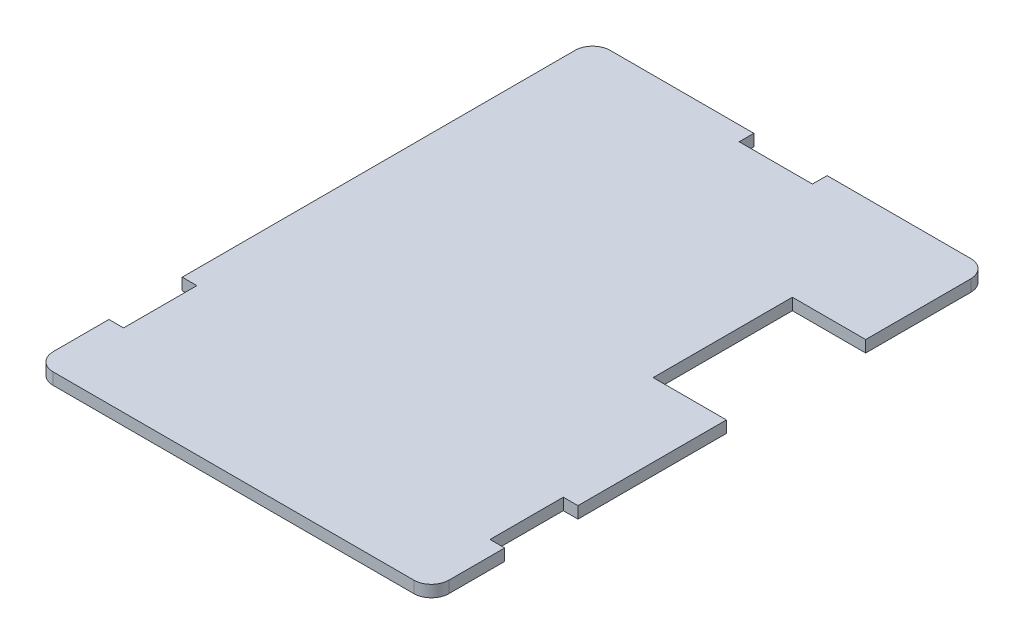
ISO-10303-21;
HEADER;
FILE_DESCRIPTION(('STEP AP214'),'2;1');
FILE_NAME('part.step','',(''),(''),'','','');
FILE_SCHEMA(('AUTOMOTIVE_DESIGN { 1 0 10303 214 1 1 1 1 }'));
ENDSEC;
DATA;
#1=APPLICATION_CONTEXT('core data for automotive mechanical design processes');
#2=APPLICATION_PROTOCOL_DEFINITION('international standard','automotive_design',2000,#1);
#3=PRODUCT_CONTEXT('',#1,'mechanical');
#4=PRODUCT('Part','Part','',(#3));
#5=PRODUCT_RELATED_PRODUCT_CATEGORY('part','',(#4));
#6=PRODUCT_DEFINITION_FORMATION('','',#4);
#7=PRODUCT_DEFINITION_CONTEXT('part definition',#1,'design');
#8=PRODUCT_DEFINITION('design','',#6,#7);
#9=PRODUCT_DEFINITION_SHAPE('','',#8);
#10=(LENGTH_UNIT() NAMED_UNIT(*) SI_UNIT(.MILLI.,.METRE.));
#11=(NAMED_UNIT(*) PLANE_ANGLE_UNIT() SI_UNIT($,.RADIAN.));
#12=(NAMED_UNIT(*) SI_UNIT($,.STERADIAN.) SOLID_ANGLE_UNIT());
#13=UNCERTAINTY_MEASURE_WITH_UNIT(LENGTH_MEASURE(1.E-05),#10,'distance_accuracy_value','');
#14=(GEOMETRIC_REPRESENTATION_CONTEXT(3) GLOBAL_UNCERTAINTY_ASSIGNED_CONTEXT((#13)) GLOBAL_UNIT_ASSIGNED_CONTEXT((#10,
#11,#12)) REPRESENTATION_CONTEXT('',''));
#15=CARTESIAN_POINT('',(0.,0.,0.));
#16=DIRECTION('',(0.,0.,1.));
#17=DIRECTION('',(1.,0.,0.));
#18=AXIS2_PLACEMENT_3D('',#15,#16,#17);
#19=CARTESIAN_POINT('',(13.5,0.8,19.));
#20=DIRECTION('',(-1.,0.,0.));
#21=DIRECTION('',(0.,0.,1.));
#22=AXIS2_PLACEMENT_3D('',#19,#20,#21);
#23=PLANE('',#22);
#24=DIRECTION('',(0.,0.,-1.));
#25=VECTOR('',#24,1.);
#26=CARTESIAN_POINT('',(13.5,0.,19.));
#27=LINE('',#26,#25);
#28=CARTESIAN_POINT('',(13.5,0.,17.8));
#29=VERTEX_POINT('',#28);
#30=CARTESIAN_POINT('',(13.5,0.,14.));
#31=VERTEX_POINT('',#30);
#32=EDGE_CURVE('E308',#29,#31,#27,.T.);
#33=ORIENTED_EDGE('',*,*,#32,.T.);
#34=DIRECTION('',(0.,1.,0.));
#35=VECTOR('',#34,1.);
#36=CARTESIAN_POINT('',(13.5,-9.2,14.));
#37=LINE('',#36,#35);
#38=CARTESIAN_POINT('',(13.5,0.8,14.));
#39=VERTEX_POINT('',#38);
#40=EDGE_CURVE('E256',#31,#39,#37,.T.);
#41=ORIENTED_EDGE('',*,*,#40,.T.);
#42=DIRECTION('',(0.,0.,-1.));
#43=VECTOR('',#42,1.);
#44=CARTESIAN_POINT('',(13.5,0.8,19.));
#45=LINE('',#44,#43);
#46=CARTESIAN_POINT('',(13.5,0.8,17.8));
#47=VERTEX_POINT('',#46);
#48=EDGE_CURVE('E292',#47,#39,#45,.T.);
#49=ORIENTED_EDGE('',*,*,#48,.F.);
#50=DIRECTION('',(0.,-1.,0.));
#51=VECTOR('',#50,1.);
#52=CARTESIAN_POINT('',(13.5,0.8,17.8));
#53=LINE('',#52,#51);
#54=EDGE_CURVE('E325',#47,#29,#53,.T.);
#55=ORIENTED_EDGE('',*,*,#54,.T.);
#56=EDGE_LOOP('',(#33,#41,#49,#55));
#57=FACE_BOUND('',#56,.T.);
#58=ADVANCED_FACE('F44',(#57),#23,.F.);
#59=CARTESIAN_POINT('',(-13.5,0.8,-19.));
#60=DIRECTION('',(0.,0.,1.));
#61=DIRECTION('',(1.,0.,0.));
#62=AXIS2_PLACEMENT_3D('',#59,#60,#61);
#63=PLANE('',#62);
#64=DIRECTION('',(-1.,0.,0.));
#65=VECTOR('',#64,1.);
#66=CARTESIAN_POINT('',(-13.5,0.8,-19.));
#67=LINE('',#66,#65);
#68=CARTESIAN_POINT('',(-2.5,0.8,-19.));
#69=VERTEX_POINT('',#68);
#70=CARTESIAN_POINT('',(-12.3,0.8,-19.));
#71=VERTEX_POINT('',#70);
#72=EDGE_CURVE('E295',#69,#71,#67,.T.);
#73=ORIENTED_EDGE('',*,*,#72,.F.);
#74=DIRECTION('',(0.,1.,0.));
#75=VECTOR('',#74,1.);
#76=CARTESIAN_POINT('',(-2.5,-9.2,-19.));
#77=LINE('',#76,#75);
#78=CARTESIAN_POINT('',(-2.5,0.,-19.));
#79=VERTEX_POINT('',#78);
#80=EDGE_CURVE('E218',#79,#69,#77,.T.);
#81=ORIENTED_EDGE('',*,*,#80,.F.);
#82=DIRECTION('',(-1.,0.,0.));
#83=VECTOR('',#82,1.);
#84=CARTESIAN_POINT('',(-13.5,0.,-19.));
#85=LINE('',#84,#83);
#86=CARTESIAN_POINT('',(-12.3,0.,-19.));
#87=VERTEX_POINT('',#86);
#88=EDGE_CURVE('E311',#79,#87,#85,.T.);
#89=ORIENTED_EDGE('',*,*,#88,.T.);
#90=DIRECTION('',(0.,-1.,0.));
#91=VECTOR('',#90,1.);
#92=CARTESIAN_POINT('',(-12.3,0.8,-19.));
#93=LINE('',#92,#91);
#94=EDGE_CURVE('E358',#87,#71,#93,.F.);
#95=ORIENTED_EDGE('',*,*,#94,.T.);
#96=EDGE_LOOP('',(#73,#81,#89,#95));
#97=FACE_BOUND('',#96,.T.);
#98=ADVANCED_FACE('F385',(#97),#63,.F.);
#99=CARTESIAN_POINT('',(-13.5,0.8,19.));
#100=DIRECTION('',(1.,0.,0.));
#101=DIRECTION('',(0.,0.,-1.));
#102=AXIS2_PLACEMENT_3D('',#99,#100,#101);
#103=PLANE('',#102);
#104=DIRECTION('',(0.,0.,1.));
#105=VECTOR('',#104,1.);
#106=CARTESIAN_POINT('',(-13.5,0.,19.));
#107=LINE('',#106,#105);
#108=CARTESIAN_POINT('',(-13.5,0.,-17.8));
#109=VERTEX_POINT('',#108);
#110=CARTESIAN_POINT('',(-13.5,0.,8.99999999999999));
#111=VERTEX_POINT('',#110);
#112=EDGE_CURVE('E317',#109,#111,#107,.T.);
#113=ORIENTED_EDGE('',*,*,#112,.T.);
#114=DIRECTION('',(0.,1.,0.));
#115=VECTOR('',#114,1.);
#116=CARTESIAN_POINT('',(-13.5,-9.2,8.99999999999999));
#117=LINE('',#116,#115);
#118=CARTESIAN_POINT('',(-13.5,0.8,8.99999999999999));
#119=VERTEX_POINT('',#118);
#120=EDGE_CURVE('E240',#111,#119,#117,.T.);
#121=ORIENTED_EDGE('',*,*,#120,.T.);
#122=DIRECTION('',(0.,0.,1.));
#123=VECTOR('',#122,1.);
#124=CARTESIAN_POINT('',(-13.5,0.8,19.));
#125=LINE('',#124,#123);
#126=CARTESIAN_POINT('',(-13.5,0.8,-17.8));
#127=VERTEX_POINT('',#126);
#128=EDGE_CURVE('E301',#127,#119,#125,.T.);
#129=ORIENTED_EDGE('',*,*,#128,.F.);
#130=DIRECTION('',(0.,-1.,0.));
#131=VECTOR('',#130,1.);
#132=CARTESIAN_POINT('',(-13.5,0.8,-17.8));
#133=LINE('',#132,#131);
#134=EDGE_CURVE('E352',#127,#109,#133,.T.);
#135=ORIENTED_EDGE('',*,*,#134,.T.);
#136=EDGE_LOOP('',(#113,#121,#129,#135));
#137=FACE_BOUND('',#136,.T.);
#138=ADVANCED_FACE('F393',(#137),#103,.F.);
#139=CARTESIAN_POINT('',(13.5,0.8,9.));
#140=VERTEX_POINT('',#139);
#141=CARTESIAN_POINT('',(13.5,0.8,-1.13));
#142=VERTEX_POINT('',#141);
#143=EDGE_CURVE('E296',#140,#142,#45,.T.);
#144=ORIENTED_EDGE('',*,*,#143,.F.);
#145=DIRECTION('',(0.,1.,0.));
#146=VECTOR('',#145,1.);
#147=CARTESIAN_POINT('',(13.5,-9.2,9.));
#148=LINE('',#147,#146);
#149=CARTESIAN_POINT('',(13.5,0.,9.));
#150=VERTEX_POINT('',#149);
#151=EDGE_CURVE('E249',#150,#140,#148,.T.);
#152=ORIENTED_EDGE('',*,*,#151,.F.);
#153=CARTESIAN_POINT('',(13.5,0.,-1.13));
#154=VERTEX_POINT('',#153);
#155=EDGE_CURVE('E312',#150,#154,#27,.T.);
#156=ORIENTED_EDGE('',*,*,#155,.T.);
#157=DIRECTION('',(0.,1.,0.));
#158=VECTOR('',#157,1.);
#159=CARTESIAN_POINT('',(13.5,-0.00100000000000002,-1.13));
#160=LINE('',#159,#158);
#161=EDGE_CURVE('E280',#154,#142,#160,.T.);
#162=ORIENTED_EDGE('',*,*,#161,.T.);
#163=EDGE_LOOP('',(#144,#152,#156,#162));
#164=FACE_BOUND('',#163,.T.);
#165=ADVANCED_FACE('F444',(#164),#23,.F.);
#166=CARTESIAN_POINT('',(13.5,0.8,-10.63));
#167=VERTEX_POINT('',#166);
#168=CARTESIAN_POINT('',(13.5,0.8,-17.8));
#169=VERTEX_POINT('',#168);
#170=EDGE_CURVE('E297',#167,#169,#45,.T.);
#171=ORIENTED_EDGE('',*,*,#170,.F.);
#172=DIRECTION('',(0.,1.,0.));
#173=VECTOR('',#172,1.);
#174=CARTESIAN_POINT('',(13.5,-0.00100000000000002,-10.63));
#175=LINE('',#174,#173);
#176=CARTESIAN_POINT('',(13.5,0.,-10.63));
#177=VERTEX_POINT('',#176);
#178=EDGE_CURVE('E279',#177,#167,#175,.T.);
#179=ORIENTED_EDGE('',*,*,#178,.F.);
#180=CARTESIAN_POINT('',(13.5,0.,-17.8));
#181=VERTEX_POINT('',#180);
#182=EDGE_CURVE('E291',#177,#181,#27,.T.);
#183=ORIENTED_EDGE('',*,*,#182,.T.);
#184=DIRECTION('',(0.,-1.,0.));
#185=VECTOR('',#184,1.);
#186=CARTESIAN_POINT('',(13.5,0.8,-17.8));
#187=LINE('',#186,#185);
#188=EDGE_CURVE('E307',#181,#169,#187,.F.);
#189=ORIENTED_EDGE('',*,*,#188,.T.);
#190=EDGE_LOOP('',(#171,#179,#183,#189));
#191=FACE_BOUND('',#190,.T.);
#192=ADVANCED_FACE('F454',(#191),#23,.F.);
#193=CARTESIAN_POINT('',(12.3,0.,-19.));
#194=VERTEX_POINT('',#193);
#195=CARTESIAN_POINT('',(2.5,0.,-19.));
#196=VERTEX_POINT('',#195);
#197=EDGE_CURVE('E313',#194,#196,#85,.T.);
#198=ORIENTED_EDGE('',*,*,#197,.T.);
#199=DIRECTION('',(0.,1.,0.));
#200=VECTOR('',#199,1.);
#201=CARTESIAN_POINT('',(2.5,-9.2,-19.));
#202=LINE('',#201,#200);
#203=CARTESIAN_POINT('',(2.5,0.8,-19.));
#204=VERTEX_POINT('',#203);
#205=EDGE_CURVE('E230',#196,#204,#202,.T.);
#206=ORIENTED_EDGE('',*,*,#205,.T.);
#207=CARTESIAN_POINT('',(12.3,0.8,-19.));
#208=VERTEX_POINT('',#207);
#209=EDGE_CURVE('E298',#208,#204,#67,.T.);
#210=ORIENTED_EDGE('',*,*,#209,.F.);
#211=DIRECTION('',(0.,-1.,0.));
#212=VECTOR('',#211,1.);
#213=CARTESIAN_POINT('',(12.3,0.8,-19.));
#214=LINE('',#213,#212);
#215=EDGE_CURVE('E361',#208,#194,#214,.T.);
#216=ORIENTED_EDGE('',*,*,#215,.T.);
#217=EDGE_LOOP('',(#198,#206,#210,#216));
#218=FACE_BOUND('',#217,.T.);
#219=ADVANCED_FACE('F460',(#218),#63,.F.);
#220=CARTESIAN_POINT('',(-13.5,0.8,14.));
#221=VERTEX_POINT('',#220);
#222=CARTESIAN_POINT('',(-13.5,0.8,17.8));
#223=VERTEX_POINT('',#222);
#224=EDGE_CURVE('E300',#221,#223,#125,.T.);
#225=ORIENTED_EDGE('',*,*,#224,.F.);
#226=DIRECTION('',(0.,1.,0.));
#227=VECTOR('',#226,1.);
#228=CARTESIAN_POINT('',(-13.5,-9.2,14.));
#229=LINE('',#228,#227);
#230=CARTESIAN_POINT('',(-13.5,0.,14.));
#231=VERTEX_POINT('',#230);
#232=EDGE_CURVE('E234',#231,#221,#229,.T.);
#233=ORIENTED_EDGE('',*,*,#232,.F.);
#234=CARTESIAN_POINT('',(-13.5,0.,17.8));
#235=VERTEX_POINT('',#234);
#236=EDGE_CURVE('E316',#231,#235,#107,.T.);
#237=ORIENTED_EDGE('',*,*,#236,.T.);
#238=DIRECTION('',(0.,-1.,0.));
#239=VECTOR('',#238,1.);
#240=CARTESIAN_POINT('',(-13.5,0.8,17.8));
#241=LINE('',#240,#239);
#242=EDGE_CURVE('E355',#235,#223,#241,.F.);
#243=ORIENTED_EDGE('',*,*,#242,.T.);
#244=EDGE_LOOP('',(#225,#233,#237,#243));
#245=FACE_BOUND('',#244,.T.);
#246=ADVANCED_FACE('F408',(#245),#103,.F.);
#247=CARTESIAN_POINT('',(-13.5,0.8,19.));
#248=DIRECTION('',(0.,0.,-1.));
#249=DIRECTION('',(-1.,0.,0.));
#250=AXIS2_PLACEMENT_3D('',#247,#248,#249);
#251=PLANE('',#250);
#252=DIRECTION('',(1.,0.,0.));
#253=VECTOR('',#252,1.);
#254=CARTESIAN_POINT('',(-13.5,0.,19.));
#255=LINE('',#254,#253);
#256=CARTESIAN_POINT('',(-12.3,0.,19.));
#257=VERTEX_POINT('',#256);
#258=CARTESIAN_POINT('',(12.3,0.,19.));
#259=VERTEX_POINT('',#258);
#260=EDGE_CURVE('E320',#257,#259,#255,.T.);
#261=ORIENTED_EDGE('',*,*,#260,.T.);
#262=DIRECTION('',(0.,-1.,0.));
#263=VECTOR('',#262,1.);
#264=CARTESIAN_POINT('',(12.3,0.8,19.));
#265=LINE('',#264,#263);
#266=CARTESIAN_POINT('',(12.3,0.8,19.));
#267=VERTEX_POINT('',#266);
#268=EDGE_CURVE('E342',#259,#267,#265,.F.);
#269=ORIENTED_EDGE('',*,*,#268,.T.);
#270=DIRECTION('',(1.,0.,0.));
#271=VECTOR('',#270,1.);
#272=CARTESIAN_POINT('',(-13.5,0.8,19.));
#273=LINE('',#272,#271);
#274=CARTESIAN_POINT('',(-12.3,0.8,19.));
#275=VERTEX_POINT('',#274);
#276=EDGE_CURVE('E304',#275,#267,#273,.T.);
#277=ORIENTED_EDGE('',*,*,#276,.F.);
#278=DIRECTION('',(0.,-1.,0.));
#279=VECTOR('',#278,1.);
#280=CARTESIAN_POINT('',(-12.3,0.8,19.));
#281=LINE('',#280,#279);
#282=EDGE_CURVE('E339',#275,#257,#281,.T.);
#283=ORIENTED_EDGE('',*,*,#282,.T.);
#284=EDGE_LOOP('',(#261,#269,#277,#283));
#285=FACE_BOUND('',#284,.T.);
#286=ADVANCED_FACE('F418',(#285),#251,.F.);
#287=CARTESIAN_POINT('',(0.,0.8,0.));
#288=DIRECTION('',(0.,-1.,0.));
#289=DIRECTION('',(0.,0.,-1.));
#290=AXIS2_PLACEMENT_3D('',#287,#288,#289);
#291=PLANE('',#290);
#292=DIRECTION('',(1.,0.,0.));
#293=VECTOR('',#292,1.);
#294=CARTESIAN_POINT('',(-2.5,0.8,-18.));
#295=LINE('',#294,#293);
#296=CARTESIAN_POINT('',(-2.5,0.8,-18.));
#297=VERTEX_POINT('',#296);
#298=CARTESIAN_POINT('',(2.5,0.8,-18.));
#299=VERTEX_POINT('',#298);
#300=EDGE_CURVE('E206',#297,#299,#295,.T.);
#301=ORIENTED_EDGE('',*,*,#300,.F.);
#302=DIRECTION('',(0.,0.,1.));
#303=VECTOR('',#302,1.);
#304=CARTESIAN_POINT('',(-2.5,0.8,-19.));
#305=LINE('',#304,#303);
#306=EDGE_CURVE('E215',#69,#297,#305,.T.);
#307=ORIENTED_EDGE('',*,*,#306,.F.);
#308=ORIENTED_EDGE('',*,*,#72,.T.);
#309=CARTESIAN_POINT('',(-12.3,0.8,-17.8));
#310=DIRECTION('',(0.,-1.,0.));
#311=DIRECTION('',(0.,0.,-1.));
#312=AXIS2_PLACEMENT_3D('',#309,#310,#311);
#313=CIRCLE('',#312,1.2);
#314=EDGE_CURVE('E344',#71,#127,#313,.F.);
#315=ORIENTED_EDGE('',*,*,#314,.T.);
#316=ORIENTED_EDGE('',*,*,#128,.T.);
#317=DIRECTION('',(-1.,0.,0.));
#318=VECTOR('',#317,1.);
#319=CARTESIAN_POINT('',(-13.5,0.8,8.99999999999999));
#320=LINE('',#319,#318);
#321=CARTESIAN_POINT('',(-12.5,0.8,8.99999999999999));
#322=VERTEX_POINT('',#321);
#323=EDGE_CURVE('E236',#322,#119,#320,.T.);
#324=ORIENTED_EDGE('',*,*,#323,.F.);
#325=DIRECTION('',(0.,0.,-1.));
#326=VECTOR('',#325,1.);
#327=CARTESIAN_POINT('',(-12.5,0.8,8.99999999999999));
#328=LINE('',#327,#326);
#329=CARTESIAN_POINT('',(-12.5,0.8,14.));
#330=VERTEX_POINT('',#329);
#331=EDGE_CURVE('E245',#330,#322,#328,.T.);
#332=ORIENTED_EDGE('',*,*,#331,.F.);
#333=DIRECTION('',(1.,0.,0.));
#334=VECTOR('',#333,1.);
#335=CARTESIAN_POINT('',(-13.5,0.8,14.));
#336=LINE('',#335,#334);
#337=EDGE_CURVE('E221',#221,#330,#336,.T.);
#338=ORIENTED_EDGE('',*,*,#337,.F.);
#339=ORIENTED_EDGE('',*,*,#224,.T.);
#340=CARTESIAN_POINT('',(-12.3,0.8,17.8));
#341=DIRECTION('',(0.,-1.,0.));
#342=DIRECTION('',(0.,0.,-1.));
#343=AXIS2_PLACEMENT_3D('',#340,#341,#342);
#344=CIRCLE('',#343,1.2);
#345=EDGE_CURVE('E348',#223,#275,#344,.F.);
#346=ORIENTED_EDGE('',*,*,#345,.T.);
#347=ORIENTED_EDGE('',*,*,#276,.T.);
#348=CARTESIAN_POINT('',(12.3,0.8,17.8));
#349=DIRECTION('',(0.,-1.,0.));
#350=DIRECTION('',(0.,0.,-1.));
#351=AXIS2_PLACEMENT_3D('',#348,#349,#350);
#352=CIRCLE('',#351,1.2);
#353=EDGE_CURVE('E350',#267,#47,#352,.F.);
#354=ORIENTED_EDGE('',*,*,#353,.T.);
#355=ORIENTED_EDGE('',*,*,#48,.T.);
#356=DIRECTION('',(1.,0.,0.));
#357=VECTOR('',#356,1.);
#358=CARTESIAN_POINT('',(13.5,0.8,14.));
#359=LINE('',#358,#357);
#360=CARTESIAN_POINT('',(12.5,0.8,14.));
#361=VERTEX_POINT('',#360);
#362=EDGE_CURVE('E251',#361,#39,#359,.T.);
#363=ORIENTED_EDGE('',*,*,#362,.F.);
#364=DIRECTION('',(0.,0.,1.));
#365=VECTOR('',#364,1.);
#366=CARTESIAN_POINT('',(12.5,0.8,9.));
#367=LINE('',#366,#365);
#368=CARTESIAN_POINT('',(12.5,0.8,9.));
#369=VERTEX_POINT('',#368);
#370=EDGE_CURVE('E260',#369,#361,#367,.T.);
#371=ORIENTED_EDGE('',*,*,#370,.F.);
#372=DIRECTION('',(-1.,0.,0.));
#373=VECTOR('',#372,1.);
#374=CARTESIAN_POINT('',(13.5,0.8,9.));
#375=LINE('',#374,#373);
#376=EDGE_CURVE('E243',#140,#369,#375,.T.);
#377=ORIENTED_EDGE('',*,*,#376,.F.);
#378=ORIENTED_EDGE('',*,*,#143,.T.);
#379=DIRECTION('',(1.,0.,0.));
#380=VECTOR('',#379,1.);
#381=CARTESIAN_POINT('',(13.5,0.8,-1.13));
#382=LINE('',#381,#380);
#383=CARTESIAN_POINT('',(8.5,0.8,-1.13));
#384=VERTEX_POINT('',#383);
#385=EDGE_CURVE('E276',#384,#142,#382,.T.);
#386=ORIENTED_EDGE('',*,*,#385,.F.);
#387=DIRECTION('',(0.,0.,1.));
#388=VECTOR('',#387,1.);
#389=CARTESIAN_POINT('',(8.5,0.8,-10.63));
#390=LINE('',#389,#388);
#391=CARTESIAN_POINT('',(8.5,0.8,-10.63));
#392=VERTEX_POINT('',#391);
#393=EDGE_CURVE('E273',#392,#384,#390,.T.);
#394=ORIENTED_EDGE('',*,*,#393,.F.);
#395=DIRECTION('',(-1.,0.,0.));
#396=VECTOR('',#395,1.);
#397=CARTESIAN_POINT('',(13.5,0.8,-10.63));
#398=LINE('',#397,#396);
#399=EDGE_CURVE('E270',#167,#392,#398,.T.);
#400=ORIENTED_EDGE('',*,*,#399,.F.);
#401=ORIENTED_EDGE('',*,*,#170,.T.);
#402=CARTESIAN_POINT('',(12.3,0.8,-17.8));
#403=DIRECTION('',(0.,-1.,0.));
#404=DIRECTION('',(0.,0.,-1.));
#405=AXIS2_PLACEMENT_3D('',#402,#403,#404);
#406=CIRCLE('',#405,1.2);
#407=EDGE_CURVE('E346',#169,#208,#406,.F.);
#408=ORIENTED_EDGE('',*,*,#407,.T.);
#409=ORIENTED_EDGE('',*,*,#209,.T.);
#410=DIRECTION('',(0.,0.,-1.));
#411=VECTOR('',#410,1.);
#412=CARTESIAN_POINT('',(2.5,0.8,-19.));
#413=LINE('',#412,#411);
#414=EDGE_CURVE('E212',#299,#204,#413,.T.);
#415=ORIENTED_EDGE('',*,*,#414,.F.);
#416=EDGE_LOOP('',(#301,#307,#308,#315,#316,#324,#332,#338,#339,#346,#347,#354,#355,#363,#371,
#377,#378,#386,#394,#400,#401,#408,#409,#415));
#417=FACE_BOUND('',#416,.T.);
#418=ADVANCED_FACE('F223',(#417),#291,.F.);
#419=CARTESIAN_POINT('',(0.,0.,0.));
#420=DIRECTION('',(0.,-1.,0.));
#421=DIRECTION('',(0.,0.,-1.));
#422=AXIS2_PLACEMENT_3D('',#419,#420,#421);
#423=PLANE('',#422);
#424=DIRECTION('',(0.,0.,-1.));
#425=VECTOR('',#424,1.);
#426=CARTESIAN_POINT('',(-2.49999999999997,0.,0.));
#427=LINE('',#426,#425);
#428=CARTESIAN_POINT('',(-2.5,0.,-18.));
#429=VERTEX_POINT('',#428);
#430=EDGE_CURVE('E11',#429,#79,#427,.T.);
#431=ORIENTED_EDGE('',*,*,#430,.F.);
#432=DIRECTION('',(-1.,0.,0.));
#433=VECTOR('',#432,1.);
#434=CARTESIAN_POINT('',(0.,0.,-18.));
#435=LINE('',#434,#433);
#436=CARTESIAN_POINT('',(2.5,0.,-18.));
#437=VERTEX_POINT('',#436);
#438=EDGE_CURVE('E209',#437,#429,#435,.T.);
#439=ORIENTED_EDGE('',*,*,#438,.F.);
#440=DIRECTION('',(0.,0.,1.));
#441=VECTOR('',#440,1.);
#442=CARTESIAN_POINT('',(2.5,0.,0.));
#443=LINE('',#442,#441);
#444=EDGE_CURVE('E52',#196,#437,#443,.T.);
#445=ORIENTED_EDGE('',*,*,#444,.F.);
#446=ORIENTED_EDGE('',*,*,#197,.F.);
#447=CARTESIAN_POINT('',(12.3,0.,-17.8));
#448=DIRECTION('',(0.,-1.,0.));
#449=DIRECTION('',(0.,0.,-1.));
#450=AXIS2_PLACEMENT_3D('',#447,#448,#449);
#451=CIRCLE('',#450,1.2);
#452=EDGE_CURVE('E331',#194,#181,#451,.T.);
#453=ORIENTED_EDGE('',*,*,#452,.T.);
#454=ORIENTED_EDGE('',*,*,#182,.F.);
#455=DIRECTION('',(-1.,0.,0.));
#456=VECTOR('',#455,1.);
#457=CARTESIAN_POINT('',(13.5,0.,-10.63));
#458=LINE('',#457,#456);
#459=CARTESIAN_POINT('',(8.5,0.,-10.63));
#460=VERTEX_POINT('',#459);
#461=EDGE_CURVE('E283',#177,#460,#458,.T.);
#462=ORIENTED_EDGE('',*,*,#461,.T.);
#463=DIRECTION('',(0.,0.,1.));
#464=VECTOR('',#463,1.);
#465=CARTESIAN_POINT('',(8.5,0.,-10.63));
#466=LINE('',#465,#464);
#467=CARTESIAN_POINT('',(8.5,0.,-1.13));
#468=VERTEX_POINT('',#467);
#469=EDGE_CURVE('E229',#460,#468,#466,.T.);
#470=ORIENTED_EDGE('',*,*,#469,.T.);
#471=DIRECTION('',(1.,0.,0.));
#472=VECTOR('',#471,1.);
#473=CARTESIAN_POINT('',(13.5,0.,-1.13));
#474=LINE('',#473,#472);
#475=EDGE_CURVE('E267',#468,#154,#474,.T.);
#476=ORIENTED_EDGE('',*,*,#475,.T.);
#477=ORIENTED_EDGE('',*,*,#155,.F.);
#478=DIRECTION('',(1.,0.,0.));
#479=VECTOR('',#478,1.);
#480=CARTESIAN_POINT('',(0.,0.,9.));
#481=LINE('',#480,#479);
#482=CARTESIAN_POINT('',(12.5,0.,9.));
#483=VERTEX_POINT('',#482);
#484=EDGE_CURVE('E364',#483,#150,#481,.T.);
#485=ORIENTED_EDGE('',*,*,#484,.F.);
#486=DIRECTION('',(0.,0.,-1.));
#487=VECTOR('',#486,1.);
#488=CARTESIAN_POINT('',(12.5,0.,0.));
#489=LINE('',#488,#487);
#490=CARTESIAN_POINT('',(12.5,0.,14.));
#491=VERTEX_POINT('',#490);
#492=EDGE_CURVE('E366',#491,#483,#489,.T.);
#493=ORIENTED_EDGE('',*,*,#492,.F.);
#494=DIRECTION('',(-1.,0.,0.));
#495=VECTOR('',#494,1.);
#496=CARTESIAN_POINT('',(0.,0.,14.));
#497=LINE('',#496,#495);
#498=EDGE_CURVE('E369',#31,#491,#497,.T.);
#499=ORIENTED_EDGE('',*,*,#498,.F.);
#500=ORIENTED_EDGE('',*,*,#32,.F.);
#501=CARTESIAN_POINT('',(12.3,0.,17.8));
#502=DIRECTION('',(0.,-1.,0.));
#503=DIRECTION('',(0.,0.,-1.));
#504=AXIS2_PLACEMENT_3D('',#501,#502,#503);
#505=CIRCLE('',#504,1.2);
#506=EDGE_CURVE('E337',#29,#259,#505,.T.);
#507=ORIENTED_EDGE('',*,*,#506,.T.);
#508=ORIENTED_EDGE('',*,*,#260,.F.);
#509=CARTESIAN_POINT('',(-12.3,0.,17.8));
#510=DIRECTION('',(0.,-1.,0.));
#511=DIRECTION('',(0.,0.,-1.));
#512=AXIS2_PLACEMENT_3D('',#509,#510,#511);
#513=CIRCLE('',#512,1.2);
#514=EDGE_CURVE('E334',#257,#235,#513,.T.);
#515=ORIENTED_EDGE('',*,*,#514,.T.);
#516=ORIENTED_EDGE('',*,*,#236,.F.);
#517=DIRECTION('',(-1.,0.,0.));
#518=VECTOR('',#517,1.);
#519=CARTESIAN_POINT('',(0.,0.,14.));
#520=LINE('',#519,#518);
#521=CARTESIAN_POINT('',(-12.5,0.,14.));
#522=VERTEX_POINT('',#521);
#523=EDGE_CURVE('E371',#522,#231,#520,.T.);
#524=ORIENTED_EDGE('',*,*,#523,.F.);
#525=DIRECTION('',(0.,0.,1.));
#526=VECTOR('',#525,1.);
#527=CARTESIAN_POINT('',(-12.5,0.,0.));
#528=LINE('',#527,#526);
#529=CARTESIAN_POINT('',(-12.5,0.,8.99999999999999));
#530=VERTEX_POINT('',#529);
#531=EDGE_CURVE('E373',#530,#522,#528,.T.);
#532=ORIENTED_EDGE('',*,*,#531,.F.);
#533=DIRECTION('',(1.,0.,0.));
#534=VECTOR('',#533,1.);
#535=CARTESIAN_POINT('',(0.,0.,8.99999999999999));
#536=LINE('',#535,#534);
#537=EDGE_CURVE('E375',#111,#530,#536,.T.);
#538=ORIENTED_EDGE('',*,*,#537,.F.);
#539=ORIENTED_EDGE('',*,*,#112,.F.);
#540=CARTESIAN_POINT('',(-12.3,0.,-17.8));
#541=DIRECTION('',(0.,-1.,0.));
#542=DIRECTION('',(0.,0.,-1.));
#543=AXIS2_PLACEMENT_3D('',#540,#541,#542);
#544=CIRCLE('',#543,1.2);
#545=EDGE_CURVE('E328',#109,#87,#544,.T.);
#546=ORIENTED_EDGE('',*,*,#545,.T.);
#547=ORIENTED_EDGE('',*,*,#88,.F.);
#548=EDGE_LOOP('',(#431,#439,#445,#446,#453,#454,#462,#470,#476,#477,#485,#493,#499,#500,#507,
#508,#515,#516,#524,#532,#538,#539,#546,#547));
#549=FACE_BOUND('',#548,.T.);
#550=ADVANCED_FACE('F382',(#549),#423,.T.);
#551=CARTESIAN_POINT('',(12.3,0.8,17.8));
#552=DIRECTION('',(0.,-1.,0.));
#553=DIRECTION('',(0.,0.,-1.));
#554=AXIS2_PLACEMENT_3D('',#551,#552,#553);
#555=CYLINDRICAL_SURFACE('',#554,1.2);
#556=ORIENTED_EDGE('',*,*,#353,.F.);
#557=ORIENTED_EDGE('',*,*,#268,.F.);
#558=ORIENTED_EDGE('',*,*,#506,.F.);
#559=ORIENTED_EDGE('',*,*,#54,.F.);
#560=EDGE_LOOP('',(#556,#557,#558,#559));
#561=FACE_BOUND('',#560,.T.);
#562=ADVANCED_FACE('F422',(#561),#555,.T.);
#563=CARTESIAN_POINT('',(-12.3,0.8,17.8));
#564=DIRECTION('',(0.,-1.,0.));
#565=DIRECTION('',(0.,0.,-1.));
#566=AXIS2_PLACEMENT_3D('',#563,#564,#565);
#567=CYLINDRICAL_SURFACE('',#566,1.2);
#568=ORIENTED_EDGE('',*,*,#345,.F.);
#569=ORIENTED_EDGE('',*,*,#242,.F.);
#570=ORIENTED_EDGE('',*,*,#514,.F.);
#571=ORIENTED_EDGE('',*,*,#282,.F.);
#572=EDGE_LOOP('',(#568,#569,#570,#571));
#573=FACE_BOUND('',#572,.T.);
#574=ADVANCED_FACE('F414',(#573),#567,.T.);
#575=CARTESIAN_POINT('',(12.3,0.8,-17.8));
#576=DIRECTION('',(0.,-1.,0.));
#577=DIRECTION('',(0.,0.,-1.));
#578=AXIS2_PLACEMENT_3D('',#575,#576,#577);
#579=CYLINDRICAL_SURFACE('',#578,1.2);
#580=ORIENTED_EDGE('',*,*,#407,.F.);
#581=ORIENTED_EDGE('',*,*,#188,.F.);
#582=ORIENTED_EDGE('',*,*,#452,.F.);
#583=ORIENTED_EDGE('',*,*,#215,.F.);
#584=EDGE_LOOP('',(#580,#581,#582,#583));
#585=FACE_BOUND('',#584,.T.);
#586=ADVANCED_FACE('F458',(#585),#579,.T.);
#587=CARTESIAN_POINT('',(-12.3,0.8,-17.8));
#588=DIRECTION('',(0.,-1.,0.));
#589=DIRECTION('',(0.,0.,-1.));
#590=AXIS2_PLACEMENT_3D('',#587,#588,#589);
#591=CYLINDRICAL_SURFACE('',#590,1.2);
#592=ORIENTED_EDGE('',*,*,#314,.F.);
#593=ORIENTED_EDGE('',*,*,#94,.F.);
#594=ORIENTED_EDGE('',*,*,#545,.F.);
#595=ORIENTED_EDGE('',*,*,#134,.F.);
#596=EDGE_LOOP('',(#592,#593,#594,#595));
#597=FACE_BOUND('',#596,.T.);
#598=ADVANCED_FACE('F46',(#597),#591,.T.);
#599=CARTESIAN_POINT('',(13.5,-0.00100000000000002,-1.13));
#600=DIRECTION('',(0.,0.,1.));
#601=DIRECTION('',(1.,0.,0.));
#602=AXIS2_PLACEMENT_3D('',#599,#600,#601);
#603=PLANE('',#602);
#604=DIRECTION('',(0.,1.,0.));
#605=VECTOR('',#604,1.);
#606=CARTESIAN_POINT('',(8.5,-0.00100000000000002,-1.13));
#607=LINE('',#606,#605);
#608=EDGE_CURVE('E284',#468,#384,#607,.T.);
#609=ORIENTED_EDGE('',*,*,#608,.T.);
#610=ORIENTED_EDGE('',*,*,#385,.T.);
#611=ORIENTED_EDGE('',*,*,#161,.F.);
#612=ORIENTED_EDGE('',*,*,#475,.F.);
#613=EDGE_LOOP('',(#609,#610,#611,#612));
#614=FACE_BOUND('',#613,.T.);
#615=ADVANCED_FACE('F462',(#614),#603,.F.);
#616=CARTESIAN_POINT('',(8.5,-0.00100000000000002,-10.63));
#617=DIRECTION('',(-1.,0.,0.));
#618=DIRECTION('',(0.,0.,1.));
#619=AXIS2_PLACEMENT_3D('',#616,#617,#618);
#620=PLANE('',#619);
#621=DIRECTION('',(0.,1.,0.));
#622=VECTOR('',#621,1.);
#623=CARTESIAN_POINT('',(8.5,-0.00100000000000002,-10.63));
#624=LINE('',#623,#622);
#625=EDGE_CURVE('E286',#460,#392,#624,.T.);
#626=ORIENTED_EDGE('',*,*,#625,.T.);
#627=ORIENTED_EDGE('',*,*,#393,.T.);
#628=ORIENTED_EDGE('',*,*,#608,.F.);
#629=ORIENTED_EDGE('',*,*,#469,.F.);
#630=EDGE_LOOP('',(#626,#627,#628,#629));
#631=FACE_BOUND('',#630,.T.);
#632=ADVANCED_FACE('F466',(#631),#620,.F.);
#633=CARTESIAN_POINT('',(13.5,-0.00100000000000002,-10.63));
#634=DIRECTION('',(0.,0.,-1.));
#635=DIRECTION('',(-1.,0.,0.));
#636=AXIS2_PLACEMENT_3D('',#633,#634,#635);
#637=PLANE('',#636);
#638=ORIENTED_EDGE('',*,*,#178,.T.);
#639=ORIENTED_EDGE('',*,*,#399,.T.);
#640=ORIENTED_EDGE('',*,*,#625,.F.);
#641=ORIENTED_EDGE('',*,*,#461,.F.);
#642=EDGE_LOOP('',(#638,#639,#640,#641));
#643=FACE_BOUND('',#642,.T.);
#644=ADVANCED_FACE('F468',(#643),#637,.F.);
#645=CARTESIAN_POINT('',(13.5,-9.2,14.));
#646=DIRECTION('',(0.,0.,1.));
#647=DIRECTION('',(1.,0.,0.));
#648=AXIS2_PLACEMENT_3D('',#645,#646,#647);
#649=PLANE('',#648);
#650=ORIENTED_EDGE('',*,*,#498,.T.);
#651=DIRECTION('',(0.,1.,0.));
#652=VECTOR('',#651,1.);
#653=CARTESIAN_POINT('',(12.5,-9.2,14.));
#654=LINE('',#653,#652);
#655=EDGE_CURVE('E254',#491,#361,#654,.T.);
#656=ORIENTED_EDGE('',*,*,#655,.T.);
#657=ORIENTED_EDGE('',*,*,#362,.T.);
#658=ORIENTED_EDGE('',*,*,#40,.F.);
#659=EDGE_LOOP('',(#650,#656,#657,#658));
#660=FACE_BOUND('',#659,.T.);
#661=ADVANCED_FACE('F430',(#660),#649,.F.);
#662=CARTESIAN_POINT('',(12.5,-9.2,9.));
#663=DIRECTION('',(-1.,0.,0.));
#664=DIRECTION('',(0.,0.,1.));
#665=AXIS2_PLACEMENT_3D('',#662,#663,#664);
#666=PLANE('',#665);
#667=ORIENTED_EDGE('',*,*,#492,.T.);
#668=DIRECTION('',(0.,1.,0.));
#669=VECTOR('',#668,1.);
#670=CARTESIAN_POINT('',(12.5,-9.2,9.));
#671=LINE('',#670,#669);
#672=EDGE_CURVE('E252',#483,#369,#671,.T.);
#673=ORIENTED_EDGE('',*,*,#672,.T.);
#674=ORIENTED_EDGE('',*,*,#370,.T.);
#675=ORIENTED_EDGE('',*,*,#655,.F.);
#676=EDGE_LOOP('',(#667,#673,#674,#675));
#677=FACE_BOUND('',#676,.T.);
#678=ADVANCED_FACE('F436',(#677),#666,.F.);
#679=CARTESIAN_POINT('',(13.5,-9.2,9.));
#680=DIRECTION('',(0.,0.,-1.));
#681=DIRECTION('',(-1.,0.,0.));
#682=AXIS2_PLACEMENT_3D('',#679,#680,#681);
#683=PLANE('',#682);
#684=ORIENTED_EDGE('',*,*,#484,.T.);
#685=ORIENTED_EDGE('',*,*,#151,.T.);
#686=ORIENTED_EDGE('',*,*,#376,.T.);
#687=ORIENTED_EDGE('',*,*,#672,.F.);
#688=EDGE_LOOP('',(#684,#685,#686,#687));
#689=FACE_BOUND('',#688,.T.);
#690=ADVANCED_FACE('F648',(#689),#683,.F.);
#691=CARTESIAN_POINT('',(-13.5,-9.2,8.99999999999999));
#692=DIRECTION('',(0.,0.,-1.));
#693=DIRECTION('',(-1.,0.,0.));
#694=AXIS2_PLACEMENT_3D('',#691,#692,#693);
#695=PLANE('',#694);
#696=ORIENTED_EDGE('',*,*,#537,.T.);
#697=DIRECTION('',(0.,1.,0.));
#698=VECTOR('',#697,1.);
#699=CARTESIAN_POINT('',(-12.5,-9.2,8.99999999999999));
#700=LINE('',#699,#698);
#701=EDGE_CURVE('E238',#530,#322,#700,.T.);
#702=ORIENTED_EDGE('',*,*,#701,.T.);
#703=ORIENTED_EDGE('',*,*,#323,.T.);
#704=ORIENTED_EDGE('',*,*,#120,.F.);
#705=EDGE_LOOP('',(#696,#702,#703,#704));
#706=FACE_BOUND('',#705,.T.);
#707=ADVANCED_FACE('F400',(#706),#695,.F.);
#708=CARTESIAN_POINT('',(-12.5,-9.2,8.99999999999999));
#709=DIRECTION('',(1.,0.,0.));
#710=DIRECTION('',(0.,0.,-1.));
#711=AXIS2_PLACEMENT_3D('',#708,#709,#710);
#712=PLANE('',#711);
#713=ORIENTED_EDGE('',*,*,#531,.T.);
#714=DIRECTION('',(0.,1.,0.));
#715=VECTOR('',#714,1.);
#716=CARTESIAN_POINT('',(-12.5,-9.2,14.));
#717=LINE('',#716,#715);
#718=EDGE_CURVE('E67',#522,#330,#717,.T.);
#719=ORIENTED_EDGE('',*,*,#718,.T.);
#720=ORIENTED_EDGE('',*,*,#331,.T.);
#721=ORIENTED_EDGE('',*,*,#701,.F.);
#722=EDGE_LOOP('',(#713,#719,#720,#721));
#723=FACE_BOUND('',#722,.T.);
#724=ADVANCED_FACE('F402',(#723),#712,.F.);
#725=CARTESIAN_POINT('',(-13.5,-9.2,14.));
#726=DIRECTION('',(0.,0.,1.));
#727=DIRECTION('',(1.,0.,0.));
#728=AXIS2_PLACEMENT_3D('',#725,#726,#727);
#729=PLANE('',#728);
#730=ORIENTED_EDGE('',*,*,#523,.T.);
#731=ORIENTED_EDGE('',*,*,#232,.T.);
#732=ORIENTED_EDGE('',*,*,#337,.T.);
#733=ORIENTED_EDGE('',*,*,#718,.F.);
#734=EDGE_LOOP('',(#730,#731,#732,#733));
#735=FACE_BOUND('',#734,.T.);
#736=ADVANCED_FACE('F673',(#735),#729,.F.);
#737=CARTESIAN_POINT('',(-2.5,-9.2,-19.));
#738=DIRECTION('',(-1.,0.,0.));
#739=DIRECTION('',(0.,0.,1.));
#740=AXIS2_PLACEMENT_3D('',#737,#738,#739);
#741=PLANE('',#740);
#742=ORIENTED_EDGE('',*,*,#430,.T.);
#743=ORIENTED_EDGE('',*,*,#80,.T.);
#744=ORIENTED_EDGE('',*,*,#306,.T.);
#745=DIRECTION('',(0.,1.,0.));
#746=VECTOR('',#745,1.);
#747=CARTESIAN_POINT('',(-2.5,-9.2,-18.));
#748=LINE('',#747,#746);
#749=EDGE_CURVE('E202',#429,#297,#748,.T.);
#750=ORIENTED_EDGE('',*,*,#749,.F.);
#751=EDGE_LOOP('',(#742,#743,#744,#750));
#752=FACE_BOUND('',#751,.T.);
#753=ADVANCED_FACE('F216',(#752),#741,.F.);
#754=CARTESIAN_POINT('',(2.5,-9.2,-19.));
#755=DIRECTION('',(1.,0.,0.));
#756=DIRECTION('',(0.,0.,-1.));
#757=AXIS2_PLACEMENT_3D('',#754,#755,#756);
#758=PLANE('',#757);
#759=ORIENTED_EDGE('',*,*,#444,.T.);
#760=DIRECTION('',(0.,1.,0.));
#761=VECTOR('',#760,1.);
#762=CARTESIAN_POINT('',(2.5,-9.2,-18.));
#763=LINE('',#762,#761);
#764=EDGE_CURVE('E59',#437,#299,#763,.T.);
#765=ORIENTED_EDGE('',*,*,#764,.T.);
#766=ORIENTED_EDGE('',*,*,#414,.T.);
#767=ORIENTED_EDGE('',*,*,#205,.F.);
#768=EDGE_LOOP('',(#759,#765,#766,#767));
#769=FACE_BOUND('',#768,.T.);
#770=ADVANCED_FACE('F379',(#769),#758,.F.);
#771=CARTESIAN_POINT('',(-2.5,-9.2,-18.));
#772=DIRECTION('',(0.,0.,1.));
#773=DIRECTION('',(1.,0.,0.));
#774=AXIS2_PLACEMENT_3D('',#771,#772,#773);
#775=PLANE('',#774);
#776=ORIENTED_EDGE('',*,*,#438,.T.);
#777=ORIENTED_EDGE('',*,*,#749,.T.);
#778=ORIENTED_EDGE('',*,*,#300,.T.);
#779=ORIENTED_EDGE('',*,*,#764,.F.);
#780=EDGE_LOOP('',(#776,#777,#778,#779));
#781=FACE_BOUND('',#780,.T.);
#782=ADVANCED_FACE('F204',(#781),#775,.F.);
#783=CLOSED_SHELL('',(#58,#98,#138,#165,#192,#219,#246,#286,#418,#550,#562,#574,#586,#598,#615,
#632,#644,#661,#678,#690,#707,#724,#736,#753,#770,#782));
#784=MANIFOLD_SOLID_BREP('B2',#783);
#785=ADVANCED_BREP_SHAPE_REPRESENTATION('',(#18,#784),#14);
#786=SHAPE_DEFINITION_REPRESENTATION(#9,#785);
ENDSEC;
END-ISO-10303-21;
